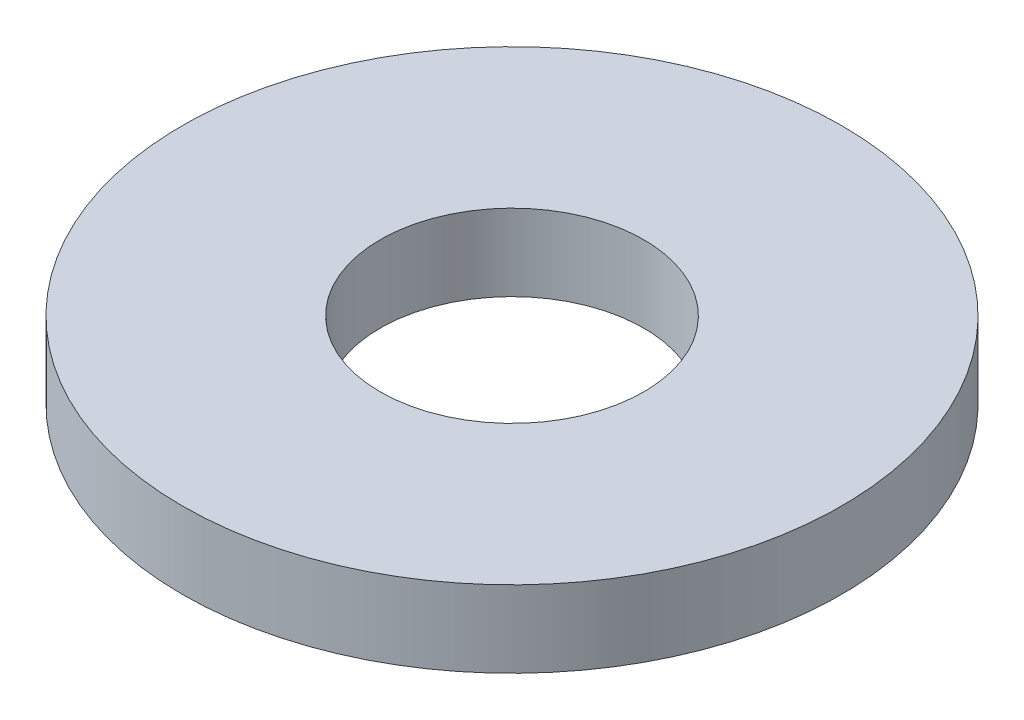
ISO-10303-21;
HEADER;
FILE_DESCRIPTION(('STEP AP214'),'2;1');
FILE_NAME('part.step','',(''),(''),'','','');
FILE_SCHEMA(('AUTOMOTIVE_DESIGN { 1 0 10303 214 1 1 1 1 }'));
ENDSEC;
DATA;
#1=APPLICATION_CONTEXT('core data for automotive mechanical design processes');
#2=APPLICATION_PROTOCOL_DEFINITION('international standard','automotive_design',2000,#1);
#3=PRODUCT_CONTEXT('',#1,'mechanical');
#4=PRODUCT('Part','Part','',(#3));
#5=PRODUCT_RELATED_PRODUCT_CATEGORY('part','',(#4));
#6=PRODUCT_DEFINITION_FORMATION('','',#4);
#7=PRODUCT_DEFINITION_CONTEXT('part definition',#1,'design');
#8=PRODUCT_DEFINITION('design','',#6,#7);
#9=PRODUCT_DEFINITION_SHAPE('','',#8);
#10=(LENGTH_UNIT() NAMED_UNIT(*) SI_UNIT(.MILLI.,.METRE.));
#11=(NAMED_UNIT(*) PLANE_ANGLE_UNIT() SI_UNIT($,.RADIAN.));
#12=(NAMED_UNIT(*) SI_UNIT($,.STERADIAN.) SOLID_ANGLE_UNIT());
#13=UNCERTAINTY_MEASURE_WITH_UNIT(LENGTH_MEASURE(1.E-05),#10,'distance_accuracy_value','');
#14=(GEOMETRIC_REPRESENTATION_CONTEXT(3) GLOBAL_UNCERTAINTY_ASSIGNED_CONTEXT((#13)) GLOBAL_UNIT_ASSIGNED_CONTEXT((#10,
#11,#12)) REPRESENTATION_CONTEXT('',''));
#15=CARTESIAN_POINT('',(0.,0.,0.));
#16=DIRECTION('',(0.,0.,1.));
#17=DIRECTION('',(1.,0.,0.));
#18=AXIS2_PLACEMENT_3D('',#15,#16,#17);
#19=CARTESIAN_POINT('',(0.,0.93,0.));
#20=DIRECTION('',(0.,1.,0.));
#21=DIRECTION('',(0.,0.,1.));
#22=AXIS2_PLACEMENT_3D('',#19,#20,#21);
#23=PLANE('',#22);
#24=CARTESIAN_POINT('',(0.,0.93,0.));
#25=DIRECTION('',(0.,1.,0.));
#26=DIRECTION('',(0.,0.,1.));
#27=AXIS2_PLACEMENT_3D('',#24,#25,#26);
#28=CIRCLE('',#27,4.);
#29=CARTESIAN_POINT('',(0.,0.93,4.));
#30=VERTEX_POINT('',#29);
#31=EDGE_CURVE('E10',#30,#30,#28,.T.);
#32=ORIENTED_EDGE('',*,*,#31,.T.);
#33=EDGE_LOOP('',(#32));
#34=FACE_BOUND('',#33,.T.);
#35=CARTESIAN_POINT('',(0.,0.93,0.));
#36=DIRECTION('',(0.,1.,0.));
#37=DIRECTION('',(0.,0.,1.));
#38=AXIS2_PLACEMENT_3D('',#35,#36,#37);
#39=CIRCLE('',#38,1.6);
#40=CARTESIAN_POINT('',(0.,0.93,1.6));
#41=VERTEX_POINT('',#40);
#42=EDGE_CURVE('E40',#41,#41,#39,.T.);
#43=ORIENTED_EDGE('',*,*,#42,.F.);
#44=EDGE_LOOP('',(#43));
#45=FACE_BOUND('',#44,.T.);
#46=ADVANCED_FACE('F29',(#34,#45),#23,.T.);
#47=CARTESIAN_POINT('',(0.,0.,0.));
#48=DIRECTION('',(0.,1.,0.));
#49=DIRECTION('',(0.,0.,1.));
#50=AXIS2_PLACEMENT_3D('',#47,#48,#49);
#51=PLANE('',#50);
#52=CARTESIAN_POINT('',(0.,0.,0.));
#53=DIRECTION('',(0.,1.,0.));
#54=DIRECTION('',(0.,0.,1.));
#55=AXIS2_PLACEMENT_3D('',#52,#53,#54);
#56=CIRCLE('',#55,4.);
#57=CARTESIAN_POINT('',(0.,0.,4.));
#58=VERTEX_POINT('',#57);
#59=EDGE_CURVE('E33',#58,#58,#56,.T.);
#60=ORIENTED_EDGE('',*,*,#59,.F.);
#61=EDGE_LOOP('',(#60));
#62=FACE_BOUND('',#61,.T.);
#63=CARTESIAN_POINT('',(0.,0.,0.));
#64=DIRECTION('',(0.,1.,0.));
#65=DIRECTION('',(0.,0.,1.));
#66=AXIS2_PLACEMENT_3D('',#63,#64,#65);
#67=CIRCLE('',#66,1.6);
#68=CARTESIAN_POINT('',(0.,0.,1.6));
#69=VERTEX_POINT('',#68);
#70=EDGE_CURVE('E42',#69,#69,#67,.T.);
#71=ORIENTED_EDGE('',*,*,#70,.T.);
#72=EDGE_LOOP('',(#71));
#73=FACE_BOUND('',#72,.T.);
#74=ADVANCED_FACE('F52',(#62,#73),#51,.F.);
#75=CARTESIAN_POINT('',(0.,0.93,0.));
#76=DIRECTION('',(0.,-1.,0.));
#77=DIRECTION('',(0.,0.,-1.));
#78=AXIS2_PLACEMENT_3D('',#75,#76,#77);
#79=CYLINDRICAL_SURFACE('',#78,4.);
#80=ORIENTED_EDGE('',*,*,#31,.F.);
#81=EDGE_LOOP('',(#80));
#82=FACE_BOUND('',#81,.T.);
#83=ORIENTED_EDGE('',*,*,#59,.T.);
#84=EDGE_LOOP('',(#83));
#85=FACE_BOUND('',#84,.T.);
#86=ADVANCED_FACE('F31',(#82,#85),#79,.T.);
#87=CARTESIAN_POINT('',(0.,0.93,0.));
#88=DIRECTION('',(0.,-1.,0.));
#89=DIRECTION('',(0.,0.,-1.));
#90=AXIS2_PLACEMENT_3D('',#87,#88,#89);
#91=CYLINDRICAL_SURFACE('',#90,1.6);
#92=ORIENTED_EDGE('',*,*,#42,.T.);
#93=EDGE_LOOP('',(#92));
#94=FACE_BOUND('',#93,.T.);
#95=ORIENTED_EDGE('',*,*,#70,.F.);
#96=EDGE_LOOP('',(#95));
#97=FACE_BOUND('',#96,.T.);
#98=ADVANCED_FACE('F48',(#94,#97),#91,.F.);
#99=CLOSED_SHELL('',(#46,#74,#86,#98));
#100=MANIFOLD_SOLID_BREP('B2',#99);
#101=ADVANCED_BREP_SHAPE_REPRESENTATION('',(#18,#100),#14);
#102=SHAPE_DEFINITION_REPRESENTATION(#9,#101);
ENDSEC;
END-ISO-10303-21;
